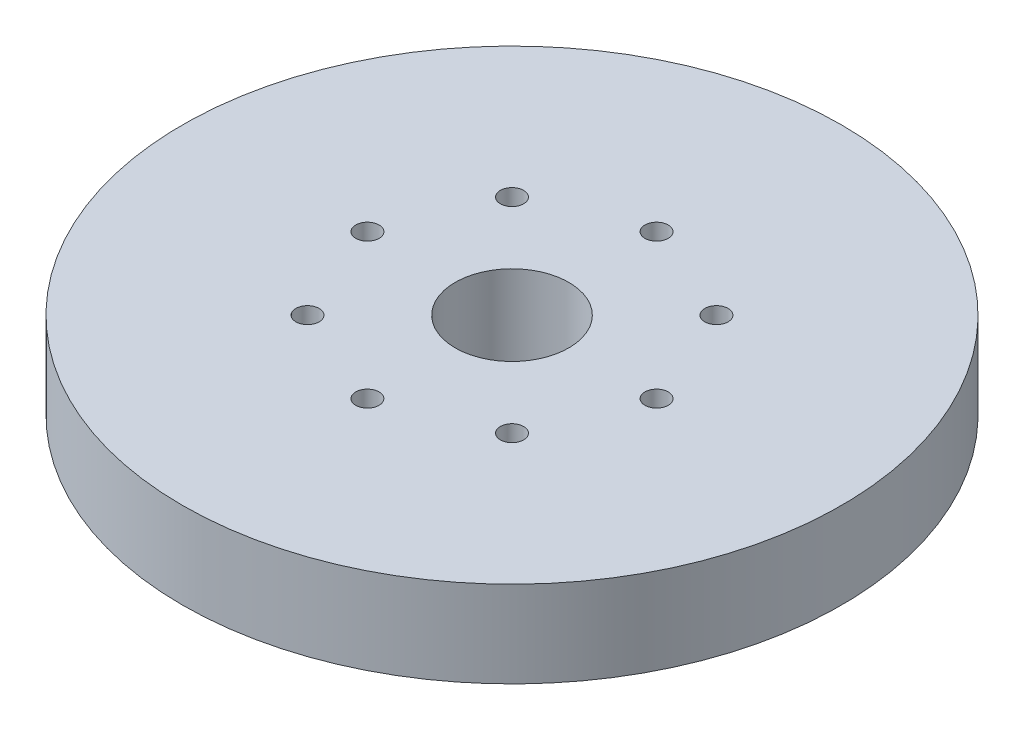
ISO-10303-21;
HEADER;
FILE_DESCRIPTION(('STEP AP214'),'2;1');
FILE_NAME('part.step','',(''),(''),'','','');
FILE_SCHEMA(('AUTOMOTIVE_DESIGN { 1 0 10303 214 1 1 1 1 }'));
ENDSEC;
DATA;
#1=APPLICATION_CONTEXT('core data for automotive mechanical design processes');
#2=APPLICATION_PROTOCOL_DEFINITION('international standard','automotive_design',2000,#1);
#3=PRODUCT_CONTEXT('',#1,'mechanical');
#4=PRODUCT('Part','Part','',(#3));
#5=PRODUCT_RELATED_PRODUCT_CATEGORY('part','',(#4));
#6=PRODUCT_DEFINITION_FORMATION('','',#4);
#7=PRODUCT_DEFINITION_CONTEXT('part definition',#1,'design');
#8=PRODUCT_DEFINITION('design','',#6,#7);
#9=PRODUCT_DEFINITION_SHAPE('','',#8);
#10=(LENGTH_UNIT() NAMED_UNIT(*) SI_UNIT(.MILLI.,.METRE.));
#11=(NAMED_UNIT(*) PLANE_ANGLE_UNIT() SI_UNIT($,.RADIAN.));
#12=(NAMED_UNIT(*) SI_UNIT($,.STERADIAN.) SOLID_ANGLE_UNIT());
#13=UNCERTAINTY_MEASURE_WITH_UNIT(LENGTH_MEASURE(1.E-05),#10,'distance_accuracy_value','');
#14=(GEOMETRIC_REPRESENTATION_CONTEXT(3) GLOBAL_UNCERTAINTY_ASSIGNED_CONTEXT((#13)) GLOBAL_UNIT_ASSIGNED_CONTEXT((#10,
#11,#12)) REPRESENTATION_CONTEXT('',''));
#15=CARTESIAN_POINT('',(0.,0.,0.));
#16=DIRECTION('',(0.,0.,1.));
#17=DIRECTION('',(1.,0.,0.));
#18=AXIS2_PLACEMENT_3D('',#15,#16,#17);
#19=CARTESIAN_POINT('',(0.,19.,0.));
#20=DIRECTION('',(0.,-1.,0.));
#21=DIRECTION('',(0.,0.,-1.));
#22=AXIS2_PLACEMENT_3D('',#19,#20,#21);
#23=CYLINDRICAL_SURFACE('',#22,72.5);
#24=CARTESIAN_POINT('',(0.,19.,0.));
#25=DIRECTION('',(0.,1.,0.));
#26=DIRECTION('',(0.,0.,1.));
#27=AXIS2_PLACEMENT_3D('',#24,#25,#26);
#28=CIRCLE('',#27,72.5);
#29=CARTESIAN_POINT('',(0.,19.,72.5));
#30=VERTEX_POINT('',#29);
#31=EDGE_CURVE('E10',#30,#30,#28,.T.);
#32=ORIENTED_EDGE('',*,*,#31,.F.);
#33=EDGE_LOOP('',(#32));
#34=FACE_BOUND('',#33,.T.);
#35=CARTESIAN_POINT('',(0.,0.,0.));
#36=DIRECTION('',(0.,1.,0.));
#37=DIRECTION('',(0.,0.,1.));
#38=AXIS2_PLACEMENT_3D('',#35,#36,#37);
#39=CIRCLE('',#38,72.5);
#40=CARTESIAN_POINT('',(0.,0.,72.5));
#41=VERTEX_POINT('',#40);
#42=EDGE_CURVE('E37',#41,#41,#39,.T.);
#43=ORIENTED_EDGE('',*,*,#42,.T.);
#44=EDGE_LOOP('',(#43));
#45=FACE_BOUND('',#44,.T.);
#46=ADVANCED_FACE('F40',(#34,#45),#23,.T.);
#47=CARTESIAN_POINT('',(0.,19.,0.));
#48=DIRECTION('',(0.,1.,0.));
#49=DIRECTION('',(0.,0.,1.));
#50=AXIS2_PLACEMENT_3D('',#47,#48,#49);
#51=PLANE('',#50);
#52=CARTESIAN_POINT('',(1.11050097125849E-13,19.,31.8060119326442));
#53=DIRECTION('',(0.,1.,0.));
#54=DIRECTION('',(1.,0.,0.));
#55=AXIS2_PLACEMENT_3D('',#52,#53,#54);
#56=CIRCLE('',#55,2.5628913839782);
#57=CARTESIAN_POINT('',(2.56289138397831,19.,31.8060119326442));
#58=VERTEX_POINT('',#57);
#59=EDGE_CURVE('E88',#58,#58,#56,.T.);
#60=ORIENTED_EDGE('',*,*,#59,.F.);
#61=EDGE_LOOP('',(#60));
#62=FACE_BOUND('',#61,.T.);
#63=CARTESIAN_POINT('',(22.4902467200731,19.,22.4902467200728));
#64=DIRECTION('',(0.,1.,0.));
#65=DIRECTION('',(0.707106781186544,0.,-0.707106781186551));
#66=AXIS2_PLACEMENT_3D('',#63,#64,#65);
#67=CIRCLE('',#66,2.5628913839782);
#68=CARTESIAN_POINT('',(24.3024845971286,19.,20.6780088430172));
#69=VERTEX_POINT('',#68);
#70=EDGE_CURVE('E79',#69,#69,#67,.T.);
#71=ORIENTED_EDGE('',*,*,#70,.F.);
#72=EDGE_LOOP('',(#71));
#73=FACE_BOUND('',#72,.T.);
#74=CARTESIAN_POINT('',(31.8060119326442,19.,0.));
#75=DIRECTION('',(0.,1.,0.));
#76=DIRECTION('',(0.,0.,-1.));
#77=AXIS2_PLACEMENT_3D('',#74,#75,#76);
#78=CIRCLE('',#77,2.5628913839782);
#79=CARTESIAN_POINT('',(31.8060119326442,19.,-2.5628913839782));
#80=VERTEX_POINT('',#79);
#81=EDGE_CURVE('E74',#80,#80,#78,.T.);
#82=ORIENTED_EDGE('',*,*,#81,.F.);
#83=EDGE_LOOP('',(#82));
#84=FACE_BOUND('',#83,.T.);
#85=CARTESIAN_POINT('',(22.4902467200727,19.,-22.4902467200731));
#86=DIRECTION('',(0.,1.,0.));
#87=DIRECTION('',(-0.707106781186554,0.,-0.707106781186541));
#88=AXIS2_PLACEMENT_3D('',#85,#86,#87);
#89=CIRCLE('',#88,2.5628913839782);
#90=CARTESIAN_POINT('',(20.6780088430172,19.,-24.3024845971287));
#91=VERTEX_POINT('',#90);
#92=EDGE_CURVE('E70',#91,#91,#89,.T.);
#93=ORIENTED_EDGE('',*,*,#92,.F.);
#94=EDGE_LOOP('',(#93));
#95=FACE_BOUND('',#94,.T.);
#96=CARTESIAN_POINT('',(-3.33150291377547E-13,19.,-31.8060119326442));
#97=DIRECTION('',(0.,1.,0.));
#98=DIRECTION('',(-1.,0.,0.));
#99=AXIS2_PLACEMENT_3D('',#96,#97,#98);
#100=CIRCLE('',#99,2.5628913839782);
#101=CARTESIAN_POINT('',(-2.56289138397853,19.,-31.8060119326441));
#102=VERTEX_POINT('',#101);
#103=EDGE_CURVE('E100',#102,#102,#100,.T.);
#104=ORIENTED_EDGE('',*,*,#103,.F.);
#105=EDGE_LOOP('',(#104));
#106=FACE_BOUND('',#105,.T.);
#107=CARTESIAN_POINT('',(-22.4902467200732,19.,-22.4902467200727));
#108=DIRECTION('',(0.,1.,0.));
#109=DIRECTION('',(-0.707106781186539,0.,0.707106781186556));
#110=AXIS2_PLACEMENT_3D('',#107,#108,#109);
#111=CIRCLE('',#110,2.5628913839782);
#112=CARTESIAN_POINT('',(-24.3024845971287,19.,-20.6780088430171));
#113=VERTEX_POINT('',#112);
#114=EDGE_CURVE('E93',#113,#113,#111,.T.);
#115=ORIENTED_EDGE('',*,*,#114,.F.);
#116=EDGE_LOOP('',(#115));
#117=FACE_BOUND('',#116,.T.);
#118=CARTESIAN_POINT('',(-22.4902467200729,19.,22.490246720073));
#119=DIRECTION('',(0.,1.,0.));
#120=DIRECTION('',(0.707106781186549,0.,0.707106781186546));
#121=AXIS2_PLACEMENT_3D('',#118,#119,#120);
#122=CIRCLE('',#121,2.5628913839782);
#123=CARTESIAN_POINT('',(-20.6780088430173,19.,24.3024845971285));
#124=VERTEX_POINT('',#123);
#125=EDGE_CURVE('E61',#124,#124,#122,.T.);
#126=ORIENTED_EDGE('',*,*,#125,.F.);
#127=EDGE_LOOP('',(#126));
#128=FACE_BOUND('',#127,.T.);
#129=CARTESIAN_POINT('',(-31.8060119326442,19.,0.));
#130=DIRECTION('',(0.,1.,0.));
#131=DIRECTION('',(0.,0.,1.));
#132=AXIS2_PLACEMENT_3D('',#129,#130,#131);
#133=CIRCLE('',#132,2.5628913839782);
#134=CARTESIAN_POINT('',(-31.8060119326442,19.,2.5628913839782));
#135=VERTEX_POINT('',#134);
#136=EDGE_CURVE('E54',#135,#135,#133,.T.);
#137=ORIENTED_EDGE('',*,*,#136,.F.);
#138=EDGE_LOOP('',(#137));
#139=FACE_BOUND('',#138,.T.);
#140=CARTESIAN_POINT('',(0.,19.,0.));
#141=DIRECTION('',(0.,1.,0.));
#142=DIRECTION('',(0.,0.,1.));
#143=AXIS2_PLACEMENT_3D('',#140,#141,#142);
#144=CIRCLE('',#143,12.5);
#145=CARTESIAN_POINT('',(0.,19.,12.5));
#146=VERTEX_POINT('',#145);
#147=EDGE_CURVE('E50',#146,#146,#144,.T.);
#148=ORIENTED_EDGE('',*,*,#147,.F.);
#149=EDGE_LOOP('',(#148));
#150=FACE_BOUND('',#149,.T.);
#151=ORIENTED_EDGE('',*,*,#31,.T.);
#152=EDGE_LOOP('',(#151));
#153=FACE_BOUND('',#152,.T.);
#154=ADVANCED_FACE('F115',(#62,#73,#84,#95,#106,#117,#128,#139,#150,#153),#51,.T.);
#155=CARTESIAN_POINT('',(0.,0.,0.));
#156=DIRECTION('',(0.,1.,0.));
#157=DIRECTION('',(0.,0.,1.));
#158=AXIS2_PLACEMENT_3D('',#155,#156,#157);
#159=PLANE('',#158);
#160=CARTESIAN_POINT('',(0.,0.,0.));
#161=DIRECTION('',(0.,1.,0.));
#162=DIRECTION('',(0.,0.,1.));
#163=AXIS2_PLACEMENT_3D('',#160,#161,#162);
#164=CIRCLE('',#163,12.5);
#165=CARTESIAN_POINT('',(0.,0.,12.5));
#166=VERTEX_POINT('',#165);
#167=EDGE_CURVE('E47',#166,#166,#164,.T.);
#168=ORIENTED_EDGE('',*,*,#167,.T.);
#169=EDGE_LOOP('',(#168));
#170=FACE_BOUND('',#169,.T.);
#171=ORIENTED_EDGE('',*,*,#42,.F.);
#172=EDGE_LOOP('',(#171));
#173=FACE_BOUND('',#172,.T.);
#174=ADVANCED_FACE('F113',(#170,#173),#159,.F.);
#175=CARTESIAN_POINT('',(0.,19.,0.));
#176=DIRECTION('',(0.,-1.,0.));
#177=DIRECTION('',(0.,0.,-1.));
#178=AXIS2_PLACEMENT_3D('',#175,#176,#177);
#179=CYLINDRICAL_SURFACE('',#178,12.5);
#180=ORIENTED_EDGE('',*,*,#147,.T.);
#181=EDGE_LOOP('',(#180));
#182=FACE_BOUND('',#181,.T.);
#183=ORIENTED_EDGE('',*,*,#167,.F.);
#184=EDGE_LOOP('',(#183));
#185=FACE_BOUND('',#184,.T.);
#186=ADVANCED_FACE('F127',(#182,#185),#179,.F.);
#187=CARTESIAN_POINT('',(-31.8060119326442,5.10147718278856,0.));
#188=DIRECTION('',(0.,1.,0.));
#189=DIRECTION('',(0.,0.,1.));
#190=AXIS2_PLACEMENT_3D('',#187,#188,#189);
#191=CYLINDRICAL_SURFACE('',#190,2.5628913839782);
#192=CARTESIAN_POINT('',(-31.8060119326442,5.10147718278856,0.));
#193=DIRECTION('',(0.,1.,0.));
#194=DIRECTION('',(0.,0.,1.));
#195=AXIS2_PLACEMENT_3D('',#192,#193,#194);
#196=CIRCLE('',#195,2.5628913839782);
#197=CARTESIAN_POINT('',(-31.8060119326442,5.10147718278856,2.5628913839782));
#198=VERTEX_POINT('',#197);
#199=EDGE_CURVE('E55',#198,#198,#196,.T.);
#200=ORIENTED_EDGE('',*,*,#199,.F.);
#201=EDGE_LOOP('',(#200));
#202=FACE_BOUND('',#201,.T.);
#203=ORIENTED_EDGE('',*,*,#136,.T.);
#204=EDGE_LOOP('',(#203));
#205=FACE_BOUND('',#204,.T.);
#206=ADVANCED_FACE('F129',(#202,#205),#191,.F.);
#207=CARTESIAN_POINT('',(-31.8060119326442,5.10147718278856,0.));
#208=DIRECTION('',(0.,1.,0.));
#209=DIRECTION('',(0.,0.,1.));
#210=AXIS2_PLACEMENT_3D('',#207,#208,#209);
#211=PLANE('',#210);
#212=ORIENTED_EDGE('',*,*,#199,.T.);
#213=EDGE_LOOP('',(#212));
#214=FACE_BOUND('',#213,.T.);
#215=ADVANCED_FACE('F157',(#214),#211,.T.);
#216=CARTESIAN_POINT('',(-22.4902467200729,5.10147718278856,22.490246720073));
#217=DIRECTION('',(0.,1.,0.));
#218=DIRECTION('',(0.,0.,1.));
#219=AXIS2_PLACEMENT_3D('',#216,#217,#218);
#220=CYLINDRICAL_SURFACE('',#219,2.5628913839782);
#221=CARTESIAN_POINT('',(-22.4902467200729,5.10147718278856,22.490246720073));
#222=DIRECTION('',(0.,1.,0.));
#223=DIRECTION('',(0.707106781186549,0.,0.707106781186546));
#224=AXIS2_PLACEMENT_3D('',#221,#222,#223);
#225=CIRCLE('',#224,2.5628913839782);
#226=CARTESIAN_POINT('',(-20.6780088430173,5.10147718278856,24.3024845971285));
#227=VERTEX_POINT('',#226);
#228=EDGE_CURVE('E59',#227,#227,#225,.T.);
#229=ORIENTED_EDGE('',*,*,#228,.F.);
#230=EDGE_LOOP('',(#229));
#231=FACE_BOUND('',#230,.T.);
#232=ORIENTED_EDGE('',*,*,#125,.T.);
#233=EDGE_LOOP('',(#232));
#234=FACE_BOUND('',#233,.T.);
#235=ADVANCED_FACE('F170',(#231,#234),#220,.F.);
#236=CARTESIAN_POINT('',(-22.4902467200729,5.10147718278856,22.490246720073));
#237=DIRECTION('',(0.,1.,0.));
#238=DIRECTION('',(0.707106781186549,0.,0.707106781186546));
#239=AXIS2_PLACEMENT_3D('',#236,#237,#238);
#240=PLANE('',#239);
#241=ORIENTED_EDGE('',*,*,#228,.T.);
#242=EDGE_LOOP('',(#241));
#243=FACE_BOUND('',#242,.T.);
#244=ADVANCED_FACE('F182',(#243),#240,.T.);
#245=CARTESIAN_POINT('',(-22.4902467200732,5.10147718278856,-22.4902467200727));
#246=DIRECTION('',(0.,1.,0.));
#247=DIRECTION('',(0.,0.,1.));
#248=AXIS2_PLACEMENT_3D('',#245,#246,#247);
#249=CYLINDRICAL_SURFACE('',#248,2.5628913839782);
#250=CARTESIAN_POINT('',(-22.4902467200732,5.10147718278856,-22.4902467200727));
#251=DIRECTION('',(0.,1.,0.));
#252=DIRECTION('',(-0.707106781186539,0.,0.707106781186556));
#253=AXIS2_PLACEMENT_3D('',#250,#251,#252);
#254=CIRCLE('',#253,2.5628913839782);
#255=CARTESIAN_POINT('',(-24.3024845971287,5.10147718278856,-20.6780088430171));
#256=VERTEX_POINT('',#255);
#257=EDGE_CURVE('E94',#256,#256,#254,.T.);
#258=ORIENTED_EDGE('',*,*,#257,.F.);
#259=EDGE_LOOP('',(#258));
#260=FACE_BOUND('',#259,.T.);
#261=ORIENTED_EDGE('',*,*,#114,.T.);
#262=EDGE_LOOP('',(#261));
#263=FACE_BOUND('',#262,.T.);
#264=ADVANCED_FACE('F189',(#260,#263),#249,.F.);
#265=CARTESIAN_POINT('',(-22.4902467200732,5.10147718278856,-22.4902467200727));
#266=DIRECTION('',(0.,1.,0.));
#267=DIRECTION('',(-0.707106781186539,0.,0.707106781186556));
#268=AXIS2_PLACEMENT_3D('',#265,#266,#267);
#269=PLANE('',#268);
#270=ORIENTED_EDGE('',*,*,#257,.T.);
#271=EDGE_LOOP('',(#270));
#272=FACE_BOUND('',#271,.T.);
#273=ADVANCED_FACE('F107',(#272),#269,.T.);
#274=CARTESIAN_POINT('',(-3.33150291377547E-13,5.10147718278856,-31.8060119326442));
#275=DIRECTION('',(0.,1.,0.));
#276=DIRECTION('',(0.,0.,1.));
#277=AXIS2_PLACEMENT_3D('',#274,#275,#276);
#278=CYLINDRICAL_SURFACE('',#277,2.5628913839782);
#279=CARTESIAN_POINT('',(-3.33150291377547E-13,5.10147718278856,-31.8060119326442));
#280=DIRECTION('',(0.,1.,0.));
#281=DIRECTION('',(-1.,0.,0.));
#282=AXIS2_PLACEMENT_3D('',#279,#280,#281);
#283=CIRCLE('',#282,2.5628913839782);
#284=CARTESIAN_POINT('',(-2.56289138397853,5.10147718278856,-31.8060119326441));
#285=VERTEX_POINT('',#284);
#286=EDGE_CURVE('E72',#285,#285,#283,.T.);
#287=ORIENTED_EDGE('',*,*,#286,.F.);
#288=EDGE_LOOP('',(#287));
#289=FACE_BOUND('',#288,.T.);
#290=ORIENTED_EDGE('',*,*,#103,.T.);
#291=EDGE_LOOP('',(#290));
#292=FACE_BOUND('',#291,.T.);
#293=ADVANCED_FACE('F104',(#289,#292),#278,.F.);
#294=CARTESIAN_POINT('',(-3.33150291377547E-13,5.10147718278856,-31.8060119326442));
#295=DIRECTION('',(0.,1.,0.));
#296=DIRECTION('',(-1.,0.,0.));
#297=AXIS2_PLACEMENT_3D('',#294,#295,#296);
#298=PLANE('',#297);
#299=ORIENTED_EDGE('',*,*,#286,.T.);
#300=EDGE_LOOP('',(#299));
#301=FACE_BOUND('',#300,.T.);
#302=ADVANCED_FACE('F103',(#301),#298,.T.);
#303=CARTESIAN_POINT('',(22.4902467200727,5.10147718278856,-22.4902467200731));
#304=DIRECTION('',(0.,1.,0.));
#305=DIRECTION('',(0.,0.,1.));
#306=AXIS2_PLACEMENT_3D('',#303,#304,#305);
#307=CYLINDRICAL_SURFACE('',#306,2.5628913839782);
#308=CARTESIAN_POINT('',(22.4902467200727,5.10147718278856,-22.4902467200731));
#309=DIRECTION('',(0.,1.,0.));
#310=DIRECTION('',(-0.707106781186554,0.,-0.707106781186541));
#311=AXIS2_PLACEMENT_3D('',#308,#309,#310);
#312=CIRCLE('',#311,2.5628913839782);
#313=CARTESIAN_POINT('',(20.6780088430172,5.10147718278856,-24.3024845971287));
#314=VERTEX_POINT('',#313);
#315=EDGE_CURVE('E69',#314,#314,#312,.T.);
#316=ORIENTED_EDGE('',*,*,#315,.F.);
#317=EDGE_LOOP('',(#316));
#318=FACE_BOUND('',#317,.T.);
#319=ORIENTED_EDGE('',*,*,#92,.T.);
#320=EDGE_LOOP('',(#319));
#321=FACE_BOUND('',#320,.T.);
#322=ADVANCED_FACE('F219',(#318,#321),#307,.F.);
#323=CARTESIAN_POINT('',(22.4902467200727,5.10147718278856,-22.4902467200731));
#324=DIRECTION('',(0.,1.,0.));
#325=DIRECTION('',(-0.707106781186554,0.,-0.707106781186541));
#326=AXIS2_PLACEMENT_3D('',#323,#324,#325);
#327=PLANE('',#326);
#328=ORIENTED_EDGE('',*,*,#315,.T.);
#329=EDGE_LOOP('',(#328));
#330=FACE_BOUND('',#329,.T.);
#331=ADVANCED_FACE('F227',(#330),#327,.T.);
#332=CARTESIAN_POINT('',(31.8060119326442,5.10147718278856,0.));
#333=DIRECTION('',(0.,1.,0.));
#334=DIRECTION('',(0.,0.,1.));
#335=AXIS2_PLACEMENT_3D('',#332,#333,#334);
#336=CYLINDRICAL_SURFACE('',#335,2.5628913839782);
#337=CARTESIAN_POINT('',(31.8060119326442,5.10147718278856,0.));
#338=DIRECTION('',(0.,1.,0.));
#339=DIRECTION('',(0.,0.,-1.));
#340=AXIS2_PLACEMENT_3D('',#337,#338,#339);
#341=CIRCLE('',#340,2.5628913839782);
#342=CARTESIAN_POINT('',(31.8060119326442,5.10147718278856,-2.5628913839782));
#343=VERTEX_POINT('',#342);
#344=EDGE_CURVE('E80',#343,#343,#341,.T.);
#345=ORIENTED_EDGE('',*,*,#344,.F.);
#346=EDGE_LOOP('',(#345));
#347=FACE_BOUND('',#346,.T.);
#348=ORIENTED_EDGE('',*,*,#81,.T.);
#349=EDGE_LOOP('',(#348));
#350=FACE_BOUND('',#349,.T.);
#351=ADVANCED_FACE('F240',(#347,#350),#336,.F.);
#352=CARTESIAN_POINT('',(31.8060119326442,5.10147718278856,0.));
#353=DIRECTION('',(0.,1.,0.));
#354=DIRECTION('',(0.,0.,-1.));
#355=AXIS2_PLACEMENT_3D('',#352,#353,#354);
#356=PLANE('',#355);
#357=ORIENTED_EDGE('',*,*,#344,.T.);
#358=EDGE_LOOP('',(#357));
#359=FACE_BOUND('',#358,.T.);
#360=ADVANCED_FACE('F246',(#359),#356,.T.);
#361=CARTESIAN_POINT('',(22.4902467200731,5.10147718278856,22.4902467200728));
#362=DIRECTION('',(0.,1.,0.));
#363=DIRECTION('',(0.,0.,1.));
#364=AXIS2_PLACEMENT_3D('',#361,#362,#363);
#365=CYLINDRICAL_SURFACE('',#364,2.5628913839782);
#366=CARTESIAN_POINT('',(22.4902467200731,5.10147718278856,22.4902467200728));
#367=DIRECTION('',(0.,1.,0.));
#368=DIRECTION('',(0.707106781186544,0.,-0.707106781186551));
#369=AXIS2_PLACEMENT_3D('',#366,#367,#368);
#370=CIRCLE('',#369,2.5628913839782);
#371=CARTESIAN_POINT('',(24.3024845971286,5.10147718278856,20.6780088430172));
#372=VERTEX_POINT('',#371);
#373=EDGE_CURVE('E82',#372,#372,#370,.T.);
#374=ORIENTED_EDGE('',*,*,#373,.F.);
#375=EDGE_LOOP('',(#374));
#376=FACE_BOUND('',#375,.T.);
#377=ORIENTED_EDGE('',*,*,#70,.T.);
#378=EDGE_LOOP('',(#377));
#379=FACE_BOUND('',#378,.T.);
#380=ADVANCED_FACE('F254',(#376,#379),#365,.F.);
#381=CARTESIAN_POINT('',(22.4902467200731,5.10147718278856,22.4902467200728));
#382=DIRECTION('',(0.,1.,0.));
#383=DIRECTION('',(0.707106781186544,0.,-0.707106781186551));
#384=AXIS2_PLACEMENT_3D('',#381,#382,#383);
#385=PLANE('',#384);
#386=ORIENTED_EDGE('',*,*,#373,.T.);
#387=EDGE_LOOP('',(#386));
#388=FACE_BOUND('',#387,.T.);
#389=ADVANCED_FACE('F262',(#388),#385,.T.);
#390=CARTESIAN_POINT('',(1.11050097125849E-13,5.10147718278856,31.8060119326442));
#391=DIRECTION('',(0.,1.,0.));
#392=DIRECTION('',(0.,0.,1.));
#393=AXIS2_PLACEMENT_3D('',#390,#391,#392);
#394=CYLINDRICAL_SURFACE('',#393,2.5628913839782);
#395=CARTESIAN_POINT('',(1.11050097125849E-13,5.10147718278856,31.8060119326442));
#396=DIRECTION('',(0.,1.,0.));
#397=DIRECTION('',(1.,0.,0.));
#398=AXIS2_PLACEMENT_3D('',#395,#396,#397);
#399=CIRCLE('',#398,2.5628913839782);
#400=CARTESIAN_POINT('',(2.56289138397831,5.10147718278856,31.8060119326442));
#401=VERTEX_POINT('',#400);
#402=EDGE_CURVE('E63',#401,#401,#399,.T.);
#403=ORIENTED_EDGE('',*,*,#402,.F.);
#404=EDGE_LOOP('',(#403));
#405=FACE_BOUND('',#404,.T.);
#406=ORIENTED_EDGE('',*,*,#59,.T.);
#407=EDGE_LOOP('',(#406));
#408=FACE_BOUND('',#407,.T.);
#409=ADVANCED_FACE('F272',(#405,#408),#394,.F.);
#410=CARTESIAN_POINT('',(1.11050097125849E-13,5.10147718278856,31.8060119326442));
#411=DIRECTION('',(0.,1.,0.));
#412=DIRECTION('',(1.,0.,0.));
#413=AXIS2_PLACEMENT_3D('',#410,#411,#412);
#414=PLANE('',#413);
#415=ORIENTED_EDGE('',*,*,#402,.T.);
#416=EDGE_LOOP('',(#415));
#417=FACE_BOUND('',#416,.T.);
#418=ADVANCED_FACE('F285',(#417),#414,.T.);
#419=CLOSED_SHELL('',(#46,#154,#174,#186,#206,#215,#235,#244,#264,#273,#293,#302,#322,#331,#351,
#360,#380,#389,#409,#418));
#420=MANIFOLD_SOLID_BREP('B2',#419);
#421=ADVANCED_BREP_SHAPE_REPRESENTATION('',(#18,#420),#14);
#422=SHAPE_DEFINITION_REPRESENTATION(#9,#421);
ENDSEC;
END-ISO-10303-21;
